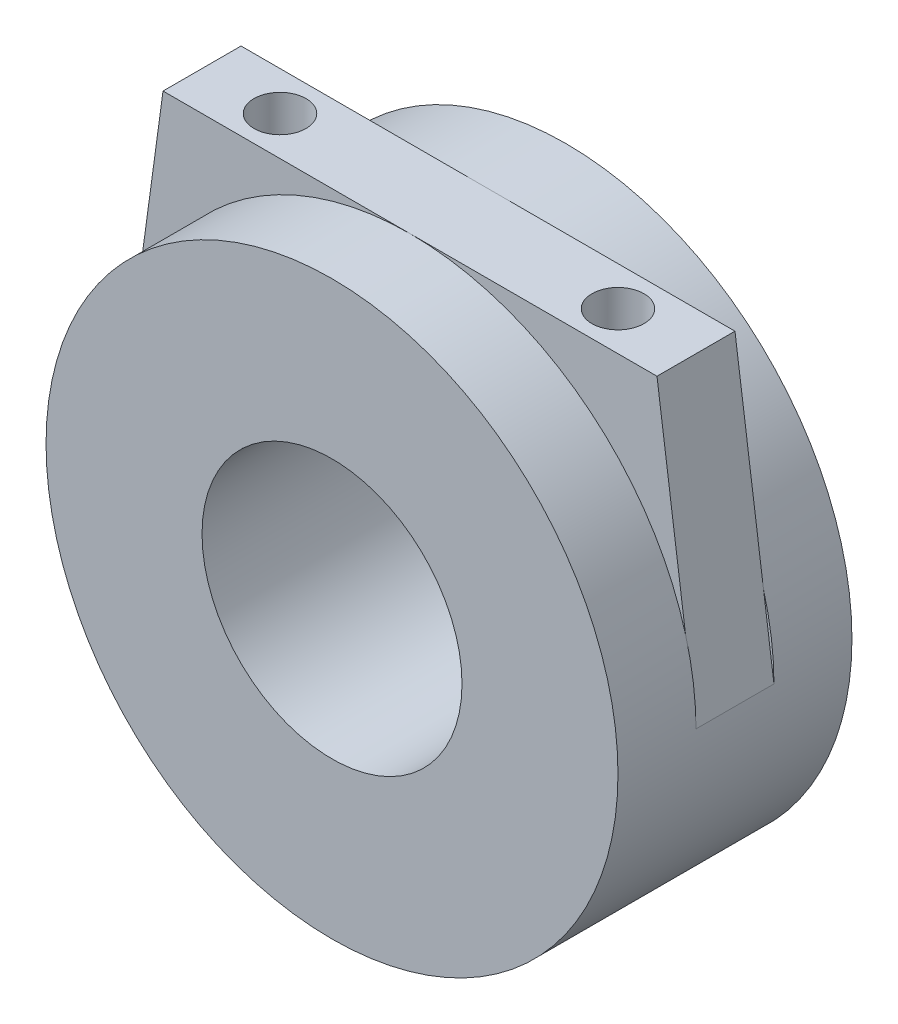
ISO-10303-21;
HEADER;
FILE_DESCRIPTION(('STEP AP214'),'2;1');
FILE_NAME('part.step','',(''),(''),'','','');
FILE_SCHEMA(('AUTOMOTIVE_DESIGN { 1 0 10303 214 1 1 1 1 }'));
ENDSEC;
DATA;
#1=APPLICATION_CONTEXT('core data for automotive mechanical design processes');
#2=APPLICATION_PROTOCOL_DEFINITION('international standard','automotive_design',2000,#1);
#3=PRODUCT_CONTEXT('',#1,'mechanical');
#4=PRODUCT('Part','Part','',(#3));
#5=PRODUCT_RELATED_PRODUCT_CATEGORY('part','',(#4));
#6=PRODUCT_DEFINITION_FORMATION('','',#4);
#7=PRODUCT_DEFINITION_CONTEXT('part definition',#1,'design');
#8=PRODUCT_DEFINITION('design','',#6,#7);
#9=PRODUCT_DEFINITION_SHAPE('','',#8);
#10=(LENGTH_UNIT() NAMED_UNIT(*) SI_UNIT(.MILLI.,.METRE.));
#11=(NAMED_UNIT(*) PLANE_ANGLE_UNIT() SI_UNIT($,.RADIAN.));
#12=(NAMED_UNIT(*) SI_UNIT($,.STERADIAN.) SOLID_ANGLE_UNIT());
#13=UNCERTAINTY_MEASURE_WITH_UNIT(LENGTH_MEASURE(1.E-05),#10,'distance_accuracy_value','');
#14=(GEOMETRIC_REPRESENTATION_CONTEXT(3) GLOBAL_UNCERTAINTY_ASSIGNED_CONTEXT((#13)) GLOBAL_UNIT_ASSIGNED_CONTEXT((#10,
#11,#12)) REPRESENTATION_CONTEXT('',''));
#15=CARTESIAN_POINT('',(0.,0.,0.));
#16=DIRECTION('',(0.,0.,1.));
#17=DIRECTION('',(1.,0.,0.));
#18=AXIS2_PLACEMENT_3D('',#15,#16,#17);
#19=CARTESIAN_POINT('',(0.,0.,6.));
#20=DIRECTION('',(0.,0.,1.));
#21=DIRECTION('',(1.,0.,0.));
#22=AXIS2_PLACEMENT_3D('',#19,#20,#21);
#23=PLANE('',#22);
#24=CARTESIAN_POINT('',(0.,0.,6.));
#25=DIRECTION('',(0.,0.,1.));
#26=DIRECTION('',(1.,0.,0.));
#27=AXIS2_PLACEMENT_3D('',#24,#25,#26);
#28=CIRCLE('',#27,11.);
#29=CARTESIAN_POINT('',(10.5983772819473,2.94523326572009,6.));
#30=VERTEX_POINT('',#29);
#31=CARTESIAN_POINT('',(0.,11.,6.));
#32=VERTEX_POINT('',#31);
#33=EDGE_CURVE('E11',#30,#32,#28,.T.);
#34=ORIENTED_EDGE('',*,*,#33,.F.);
#35=DIRECTION('',(-0.135113204733314,0.990830168044299,0.));
#36=VECTOR('',#35,1.);
#37=CARTESIAN_POINT('',(9.5,11.,6.));
#38=LINE('',#37,#36);
#39=CARTESIAN_POINT('',(9.5,11.,6.));
#40=VERTEX_POINT('',#39);
#41=EDGE_CURVE('E124',#30,#40,#38,.T.);
#42=ORIENTED_EDGE('',*,*,#41,.T.);
#43=DIRECTION('',(-1.,0.,0.));
#44=VECTOR('',#43,1.);
#45=CARTESIAN_POINT('',(-9.49999999999999,11.,6.));
#46=LINE('',#45,#44);
#47=EDGE_CURVE('E172',#40,#32,#46,.T.);
#48=ORIENTED_EDGE('',*,*,#47,.T.);
#49=EDGE_LOOP('',(#34,#42,#48));
#50=FACE_BOUND('',#49,.T.);
#51=ADVANCED_FACE('F43',(#50),#23,.T.);
#52=CARTESIAN_POINT('',(0.,0.,3.));
#53=DIRECTION('',(0.,0.,1.));
#54=DIRECTION('',(1.,0.,0.));
#55=AXIS2_PLACEMENT_3D('',#52,#53,#54);
#56=PLANE('',#55);
#57=DIRECTION('',(-0.135113204733314,-0.990830168044299,0.));
#58=VECTOR('',#57,1.);
#59=CARTESIAN_POINT('',(-11.,0.,3.));
#60=LINE('',#59,#58);
#61=CARTESIAN_POINT('',(-10.5983772819473,2.94523326572009,3.));
#62=VERTEX_POINT('',#61);
#63=CARTESIAN_POINT('',(-11.,0.,3.));
#64=VERTEX_POINT('',#63);
#65=EDGE_CURVE('E140',#62,#64,#60,.T.);
#66=ORIENTED_EDGE('',*,*,#65,.F.);
#67=CARTESIAN_POINT('',(0.,0.,3.));
#68=DIRECTION('',(0.,0.,1.));
#69=DIRECTION('',(1.,0.,0.));
#70=AXIS2_PLACEMENT_3D('',#67,#68,#69);
#71=CIRCLE('',#70,11.);
#72=EDGE_CURVE('E149',#62,#64,#71,.T.);
#73=ORIENTED_EDGE('',*,*,#72,.T.);
#74=EDGE_LOOP('',(#66,#73));
#75=FACE_BOUND('',#74,.T.);
#76=ADVANCED_FACE('F199',(#75),#56,.T.);
#77=CARTESIAN_POINT('',(0.,0.,3.));
#78=DIRECTION('',(0.,0.,-1.));
#79=DIRECTION('',(-1.,0.,0.));
#80=AXIS2_PLACEMENT_3D('',#77,#78,#79);
#81=CYLINDRICAL_SURFACE('',#80,11.);
#82=CARTESIAN_POINT('',(11.,0.,3.));
#83=VERTEX_POINT('',#82);
#84=CARTESIAN_POINT('',(10.5983772819473,2.94523326572009,3.));
#85=VERTEX_POINT('',#84);
#86=EDGE_CURVE('E113',#83,#85,#71,.T.);
#87=ORIENTED_EDGE('',*,*,#86,.F.);
#88=DIRECTION('',(0.,0.,-1.));
#89=VECTOR('',#88,1.);
#90=CARTESIAN_POINT('',(11.,0.,6.));
#91=LINE('',#90,#89);
#92=CARTESIAN_POINT('',(11.,0.,6.));
#93=VERTEX_POINT('',#92);
#94=EDGE_CURVE('E107',#93,#83,#91,.T.);
#95=ORIENTED_EDGE('',*,*,#94,.F.);
#96=EDGE_CURVE('E111',#93,#30,#28,.T.);
#97=ORIENTED_EDGE('',*,*,#96,.T.);
#98=ORIENTED_EDGE('',*,*,#33,.T.);
#99=CARTESIAN_POINT('',(-10.5983772819473,2.94523326572009,6.));
#100=VERTEX_POINT('',#99);
#101=EDGE_CURVE('E53',#32,#100,#28,.T.);
#102=ORIENTED_EDGE('',*,*,#101,.T.);
#103=CARTESIAN_POINT('',(-11.,0.,6.));
#104=VERTEX_POINT('',#103);
#105=EDGE_CURVE('E55',#100,#104,#28,.T.);
#106=ORIENTED_EDGE('',*,*,#105,.T.);
#107=DIRECTION('',(0.,0.,-1.));
#108=VECTOR('',#107,1.);
#109=CARTESIAN_POINT('',(-11.,0.,6.));
#110=LINE('',#109,#108);
#111=EDGE_CURVE('E171',#104,#64,#110,.T.);
#112=ORIENTED_EDGE('',*,*,#111,.T.);
#113=ORIENTED_EDGE('',*,*,#72,.F.);
#114=CARTESIAN_POINT('',(0.,11.,3.));
#115=VERTEX_POINT('',#114);
#116=EDGE_CURVE('E225',#115,#62,#71,.T.);
#117=ORIENTED_EDGE('',*,*,#116,.F.);
#118=EDGE_CURVE('E148',#85,#115,#71,.T.);
#119=ORIENTED_EDGE('',*,*,#118,.F.);
#120=EDGE_LOOP('',(#87,#95,#97,#98,#102,#106,#112,#113,#117,#119));
#121=FACE_BOUND('',#120,.T.);
#122=CARTESIAN_POINT('',(0.,0.,0.));
#123=DIRECTION('',(0.,0.,1.));
#124=DIRECTION('',(1.,0.,0.));
#125=AXIS2_PLACEMENT_3D('',#122,#123,#124);
#126=CIRCLE('',#125,11.);
#127=CARTESIAN_POINT('',(11.,0.,0.));
#128=VERTEX_POINT('',#127);
#129=EDGE_CURVE('E47',#128,#128,#126,.T.);
#130=ORIENTED_EDGE('',*,*,#129,.T.);
#131=EDGE_LOOP('',(#130));
#132=FACE_BOUND('',#131,.T.);
#133=CARTESIAN_POINT('',(0.,0.,9.));
#134=DIRECTION('',(0.,0.,1.));
#135=DIRECTION('',(1.,0.,0.));
#136=AXIS2_PLACEMENT_3D('',#133,#134,#135);
#137=CIRCLE('',#136,11.);
#138=CARTESIAN_POINT('',(11.,0.,9.));
#139=VERTEX_POINT('',#138);
#140=EDGE_CURVE('E131',#139,#139,#137,.T.);
#141=ORIENTED_EDGE('',*,*,#140,.F.);
#142=EDGE_LOOP('',(#141));
#143=FACE_BOUND('',#142,.T.);
#144=ADVANCED_FACE('F45',(#121,#132,#143),#81,.T.);
#145=DIRECTION('',(-0.135113204733314,0.990830168044299,0.));
#146=VECTOR('',#145,1.);
#147=CARTESIAN_POINT('',(9.5,11.,3.));
#148=LINE('',#147,#146);
#149=EDGE_CURVE('E164',#83,#85,#148,.T.);
#150=ORIENTED_EDGE('',*,*,#149,.F.);
#151=ORIENTED_EDGE('',*,*,#86,.T.);
#152=EDGE_LOOP('',(#150,#151));
#153=FACE_BOUND('',#152,.T.);
#154=ADVANCED_FACE('F205',(#153),#56,.T.);
#155=CARTESIAN_POINT('',(0.,0.,0.));
#156=DIRECTION('',(0.,0.,1.));
#157=DIRECTION('',(1.,0.,0.));
#158=AXIS2_PLACEMENT_3D('',#155,#156,#157);
#159=PLANE('',#158);
#160=CARTESIAN_POINT('',(0.,0.,0.));
#161=DIRECTION('',(0.,0.,1.));
#162=DIRECTION('',(1.,0.,0.));
#163=AXIS2_PLACEMENT_3D('',#160,#161,#162);
#164=CIRCLE('',#163,5.);
#165=CARTESIAN_POINT('',(5.,0.,0.));
#166=VERTEX_POINT('',#165);
#167=EDGE_CURVE('E138',#166,#166,#164,.T.);
#168=ORIENTED_EDGE('',*,*,#167,.T.);
#169=EDGE_LOOP('',(#168));
#170=FACE_BOUND('',#169,.T.);
#171=ORIENTED_EDGE('',*,*,#129,.F.);
#172=EDGE_LOOP('',(#171));
#173=FACE_BOUND('',#172,.T.);
#174=ADVANCED_FACE('F211',(#170,#173),#159,.F.);
#175=CARTESIAN_POINT('',(0.,0.,3.));
#176=DIRECTION('',(0.,0.,1.));
#177=DIRECTION('',(1.,0.,0.));
#178=AXIS2_PLACEMENT_3D('',#175,#176,#177);
#179=PLANE('',#178);
#180=CARTESIAN_POINT('',(9.5,11.,3.));
#181=VERTEX_POINT('',#180);
#182=EDGE_CURVE('E135',#85,#181,#148,.T.);
#183=ORIENTED_EDGE('',*,*,#182,.F.);
#184=ORIENTED_EDGE('',*,*,#118,.T.);
#185=DIRECTION('',(-1.,0.,0.));
#186=VECTOR('',#185,1.);
#187=CARTESIAN_POINT('',(-9.49999999999999,11.,3.));
#188=LINE('',#187,#186);
#189=EDGE_CURVE('E153',#181,#115,#188,.T.);
#190=ORIENTED_EDGE('',*,*,#189,.F.);
#191=EDGE_LOOP('',(#183,#184,#190));
#192=FACE_BOUND('',#191,.T.);
#193=ADVANCED_FACE('F208',(#192),#179,.F.);
#194=CARTESIAN_POINT('',(-9.49999999999999,11.,3.));
#195=VERTEX_POINT('',#194);
#196=EDGE_CURVE('E159',#115,#195,#188,.T.);
#197=ORIENTED_EDGE('',*,*,#196,.F.);
#198=ORIENTED_EDGE('',*,*,#116,.T.);
#199=EDGE_CURVE('E144',#195,#62,#60,.T.);
#200=ORIENTED_EDGE('',*,*,#199,.F.);
#201=EDGE_LOOP('',(#197,#198,#200));
#202=FACE_BOUND('',#201,.T.);
#203=ADVANCED_FACE('F210',(#202),#179,.F.);
#204=CARTESIAN_POINT('',(9.5,11.,6.));
#205=DIRECTION('',(-0.990830168044299,-0.135113204733314,0.));
#206=DIRECTION('',(0.135113204733314,-0.990830168044299,0.));
#207=AXIS2_PLACEMENT_3D('',#204,#205,#206);
#208=PLANE('',#207);
#209=ORIENTED_EDGE('',*,*,#149,.T.);
#210=ORIENTED_EDGE('',*,*,#182,.T.);
#211=DIRECTION('',(0.,0.,-1.));
#212=VECTOR('',#211,1.);
#213=CARTESIAN_POINT('',(9.5,11.,6.));
#214=LINE('',#213,#212);
#215=EDGE_CURVE('E117',#40,#181,#214,.T.);
#216=ORIENTED_EDGE('',*,*,#215,.F.);
#217=ORIENTED_EDGE('',*,*,#41,.F.);
#218=EDGE_CURVE('E121',#93,#30,#38,.T.);
#219=ORIENTED_EDGE('',*,*,#218,.F.);
#220=ORIENTED_EDGE('',*,*,#94,.T.);
#221=EDGE_LOOP('',(#209,#210,#216,#217,#219,#220));
#222=FACE_BOUND('',#221,.T.);
#223=ADVANCED_FACE('F122',(#222),#208,.F.);
#224=CARTESIAN_POINT('',(-9.49999999999999,11.,6.));
#225=DIRECTION('',(0.,-1.,0.));
#226=DIRECTION('',(1.,0.,0.));
#227=AXIS2_PLACEMENT_3D('',#224,#225,#226);
#228=PLANE('',#227);
#229=CARTESIAN_POINT('',(-6.5,11.,4.5));
#230=DIRECTION('',(0.,1.,0.));
#231=DIRECTION('',(-1.,0.,0.));
#232=AXIS2_PLACEMENT_3D('',#229,#230,#231);
#233=CIRCLE('',#232,1.);
#234=CARTESIAN_POINT('',(-7.5,11.,4.5));
#235=VERTEX_POINT('',#234);
#236=EDGE_CURVE('E418',#235,#235,#233,.T.);
#237=ORIENTED_EDGE('',*,*,#236,.F.);
#238=EDGE_LOOP('',(#237));
#239=FACE_BOUND('',#238,.T.);
#240=CARTESIAN_POINT('',(6.5,11.,4.5));
#241=DIRECTION('',(0.,1.,0.));
#242=DIRECTION('',(-1.,0.,0.));
#243=AXIS2_PLACEMENT_3D('',#240,#241,#242);
#244=CIRCLE('',#243,1.);
#245=CARTESIAN_POINT('',(5.5,11.,4.5));
#246=VERTEX_POINT('',#245);
#247=EDGE_CURVE('E425',#246,#246,#244,.T.);
#248=ORIENTED_EDGE('',*,*,#247,.F.);
#249=EDGE_LOOP('',(#248));
#250=FACE_BOUND('',#249,.T.);
#251=ORIENTED_EDGE('',*,*,#189,.T.);
#252=ORIENTED_EDGE('',*,*,#196,.T.);
#253=DIRECTION('',(0.,0.,-1.));
#254=VECTOR('',#253,1.);
#255=CARTESIAN_POINT('',(-9.49999999999999,11.,6.));
#256=LINE('',#255,#254);
#257=CARTESIAN_POINT('',(-9.49999999999999,11.,6.));
#258=VERTEX_POINT('',#257);
#259=EDGE_CURVE('E182',#258,#195,#256,.T.);
#260=ORIENTED_EDGE('',*,*,#259,.F.);
#261=EDGE_CURVE('E127',#32,#258,#46,.T.);
#262=ORIENTED_EDGE('',*,*,#261,.F.);
#263=ORIENTED_EDGE('',*,*,#47,.F.);
#264=ORIENTED_EDGE('',*,*,#215,.T.);
#265=EDGE_LOOP('',(#251,#252,#260,#262,#263,#264));
#266=FACE_BOUND('',#265,.T.);
#267=ADVANCED_FACE('F183',(#239,#250,#266),#228,.F.);
#268=CARTESIAN_POINT('',(-11.,0.,6.));
#269=DIRECTION('',(0.990830168044299,-0.135113204733314,0.));
#270=DIRECTION('',(0.135113204733314,0.990830168044299,0.));
#271=AXIS2_PLACEMENT_3D('',#268,#269,#270);
#272=PLANE('',#271);
#273=ORIENTED_EDGE('',*,*,#199,.T.);
#274=ORIENTED_EDGE('',*,*,#65,.T.);
#275=ORIENTED_EDGE('',*,*,#111,.F.);
#276=DIRECTION('',(-0.135113204733314,-0.990830168044299,0.));
#277=VECTOR('',#276,1.);
#278=CARTESIAN_POINT('',(-11.,0.,6.));
#279=LINE('',#278,#277);
#280=EDGE_CURVE('E62',#100,#104,#279,.T.);
#281=ORIENTED_EDGE('',*,*,#280,.F.);
#282=EDGE_CURVE('E168',#258,#100,#279,.T.);
#283=ORIENTED_EDGE('',*,*,#282,.F.);
#284=ORIENTED_EDGE('',*,*,#259,.T.);
#285=EDGE_LOOP('',(#273,#274,#275,#281,#283,#284));
#286=FACE_BOUND('',#285,.T.);
#287=ADVANCED_FACE('F187',(#286),#272,.F.);
#288=ORIENTED_EDGE('',*,*,#101,.F.);
#289=ORIENTED_EDGE('',*,*,#261,.T.);
#290=ORIENTED_EDGE('',*,*,#282,.T.);
#291=EDGE_LOOP('',(#288,#289,#290));
#292=FACE_BOUND('',#291,.T.);
#293=ADVANCED_FACE('F180',(#292),#23,.T.);
#294=CARTESIAN_POINT('',(0.,0.,6.));
#295=DIRECTION('',(0.,0.,1.));
#296=DIRECTION('',(1.,0.,0.));
#297=AXIS2_PLACEMENT_3D('',#294,#295,#296);
#298=PLANE('',#297);
#299=ORIENTED_EDGE('',*,*,#96,.F.);
#300=ORIENTED_EDGE('',*,*,#218,.T.);
#301=EDGE_LOOP('',(#299,#300));
#302=FACE_BOUND('',#301,.T.);
#303=ADVANCED_FACE('F129',(#302),#298,.F.);
#304=ORIENTED_EDGE('',*,*,#105,.F.);
#305=ORIENTED_EDGE('',*,*,#280,.T.);
#306=EDGE_LOOP('',(#304,#305));
#307=FACE_BOUND('',#306,.T.);
#308=ADVANCED_FACE('F232',(#307),#298,.F.);
#309=CARTESIAN_POINT('',(0.,0.,9.));
#310=DIRECTION('',(0.,0.,1.));
#311=DIRECTION('',(1.,0.,0.));
#312=AXIS2_PLACEMENT_3D('',#309,#310,#311);
#313=PLANE('',#312);
#314=CARTESIAN_POINT('',(0.,0.,9.));
#315=DIRECTION('',(0.,0.,1.));
#316=DIRECTION('',(1.,0.,0.));
#317=AXIS2_PLACEMENT_3D('',#314,#315,#316);
#318=CIRCLE('',#317,5.);
#319=CARTESIAN_POINT('',(5.,0.,9.));
#320=VERTEX_POINT('',#319);
#321=EDGE_CURVE('E410',#320,#320,#318,.T.);
#322=ORIENTED_EDGE('',*,*,#321,.F.);
#323=EDGE_LOOP('',(#322));
#324=FACE_BOUND('',#323,.T.);
#325=ORIENTED_EDGE('',*,*,#140,.T.);
#326=EDGE_LOOP('',(#325));
#327=FACE_BOUND('',#326,.T.);
#328=ADVANCED_FACE('F234',(#324,#327),#313,.T.);
#329=CARTESIAN_POINT('',(0.,0.,0.));
#330=DIRECTION('',(0.,0.,1.));
#331=DIRECTION('',(1.,0.,0.));
#332=AXIS2_PLACEMENT_3D('',#329,#330,#331);
#333=CYLINDRICAL_SURFACE('',#332,5.);
#334=ORIENTED_EDGE('',*,*,#167,.F.);
#335=EDGE_LOOP('',(#334));
#336=FACE_BOUND('',#335,.T.);
#337=ORIENTED_EDGE('',*,*,#321,.T.);
#338=EDGE_LOOP('',(#337));
#339=FACE_BOUND('',#338,.T.);
#340=ADVANCED_FACE('F239',(#336,#339),#333,.F.);
#341=CARTESIAN_POINT('',(6.5,8.,4.5));
#342=DIRECTION('',(0.,1.,0.));
#343=DIRECTION('',(-1.,0.,0.));
#344=AXIS2_PLACEMENT_3D('',#341,#342,#343);
#345=CYLINDRICAL_SURFACE('',#344,1.);
#346=CARTESIAN_POINT('',(6.5,8.,4.5));
#347=DIRECTION('',(0.,1.,0.));
#348=DIRECTION('',(-1.,0.,0.));
#349=AXIS2_PLACEMENT_3D('',#346,#347,#348);
#350=CIRCLE('',#349,1.);
#351=CARTESIAN_POINT('',(5.5,8.,4.5));
#352=VERTEX_POINT('',#351);
#353=EDGE_CURVE('E421',#352,#352,#350,.T.);
#354=ORIENTED_EDGE('',*,*,#353,.F.);
#355=EDGE_LOOP('',(#354));
#356=FACE_BOUND('',#355,.T.);
#357=ORIENTED_EDGE('',*,*,#247,.T.);
#358=EDGE_LOOP('',(#357));
#359=FACE_BOUND('',#358,.T.);
#360=ADVANCED_FACE('F330',(#356,#359),#345,.F.);
#361=CARTESIAN_POINT('',(6.5,8.,4.5));
#362=DIRECTION('',(0.,1.,0.));
#363=DIRECTION('',(-1.,0.,0.));
#364=AXIS2_PLACEMENT_3D('',#361,#362,#363);
#365=PLANE('',#364);
#366=ORIENTED_EDGE('',*,*,#353,.T.);
#367=EDGE_LOOP('',(#366));
#368=FACE_BOUND('',#367,.T.);
#369=ADVANCED_FACE('F335',(#368),#365,.T.);
#370=CARTESIAN_POINT('',(-6.5,8.,4.5));
#371=DIRECTION('',(0.,1.,0.));
#372=DIRECTION('',(-1.,0.,0.));
#373=AXIS2_PLACEMENT_3D('',#370,#371,#372);
#374=CYLINDRICAL_SURFACE('',#373,1.);
#375=CARTESIAN_POINT('',(-6.5,8.,4.5));
#376=DIRECTION('',(0.,1.,0.));
#377=DIRECTION('',(-1.,0.,0.));
#378=AXIS2_PLACEMENT_3D('',#375,#376,#377);
#379=CIRCLE('',#378,1.);
#380=CARTESIAN_POINT('',(-7.5,8.,4.5));
#381=VERTEX_POINT('',#380);
#382=EDGE_CURVE('E412',#381,#381,#379,.T.);
#383=ORIENTED_EDGE('',*,*,#382,.F.);
#384=EDGE_LOOP('',(#383));
#385=FACE_BOUND('',#384,.T.);
#386=ORIENTED_EDGE('',*,*,#236,.T.);
#387=EDGE_LOOP('',(#386));
#388=FACE_BOUND('',#387,.T.);
#389=ADVANCED_FACE('F346',(#385,#388),#374,.F.);
#390=CARTESIAN_POINT('',(-6.5,8.,4.5));
#391=DIRECTION('',(0.,1.,0.));
#392=DIRECTION('',(-1.,0.,0.));
#393=AXIS2_PLACEMENT_3D('',#390,#391,#392);
#394=PLANE('',#393);
#395=ORIENTED_EDGE('',*,*,#382,.T.);
#396=EDGE_LOOP('',(#395));
#397=FACE_BOUND('',#396,.T.);
#398=ADVANCED_FACE('F357',(#397),#394,.T.);
#399=CLOSED_SHELL('',(#51,#76,#144,#154,#174,#193,#203,#223,#267,#287,#293,#303,#308,#328,#340,
#360,#369,#389,#398));
#400=MANIFOLD_SOLID_BREP('B2',#399);
#401=ADVANCED_BREP_SHAPE_REPRESENTATION('',(#18,#400),#14);
#402=SHAPE_DEFINITION_REPRESENTATION(#9,#401);
ENDSEC;
END-ISO-10303-21;
